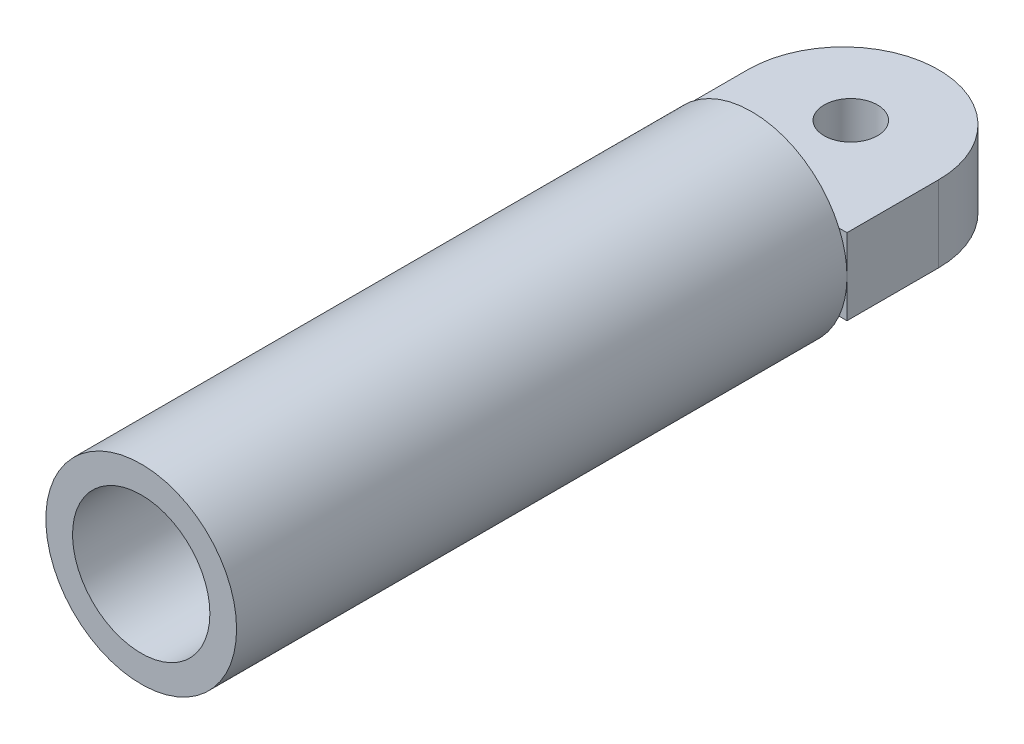
ISO-10303-21;
HEADER;
FILE_DESCRIPTION(('STEP AP214'),'2;1');
FILE_NAME('part.step','',(''),(''),'','','');
FILE_SCHEMA(('AUTOMOTIVE_DESIGN { 1 0 10303 214 1 1 1 1 }'));
ENDSEC;
DATA;
#1=APPLICATION_CONTEXT('core data for automotive mechanical design processes');
#2=APPLICATION_PROTOCOL_DEFINITION('international standard','automotive_design',2000,#1);
#3=PRODUCT_CONTEXT('',#1,'mechanical');
#4=PRODUCT('Part','Part','',(#3));
#5=PRODUCT_RELATED_PRODUCT_CATEGORY('part','',(#4));
#6=PRODUCT_DEFINITION_FORMATION('','',#4);
#7=PRODUCT_DEFINITION_CONTEXT('part definition',#1,'design');
#8=PRODUCT_DEFINITION('design','',#6,#7);
#9=PRODUCT_DEFINITION_SHAPE('','',#8);
#10=(LENGTH_UNIT() NAMED_UNIT(*) SI_UNIT(.MILLI.,.METRE.));
#11=(NAMED_UNIT(*) PLANE_ANGLE_UNIT() SI_UNIT($,.RADIAN.));
#12=(NAMED_UNIT(*) SI_UNIT($,.STERADIAN.) SOLID_ANGLE_UNIT());
#13=UNCERTAINTY_MEASURE_WITH_UNIT(LENGTH_MEASURE(1.E-05),#10,'distance_accuracy_value','');
#14=(GEOMETRIC_REPRESENTATION_CONTEXT(3) GLOBAL_UNCERTAINTY_ASSIGNED_CONTEXT((#13)) GLOBAL_UNIT_ASSIGNED_CONTEXT((#10,
#11,#12)) REPRESENTATION_CONTEXT('',''));
#15=CARTESIAN_POINT('',(0.,0.,0.));
#16=DIRECTION('',(0.,0.,1.));
#17=DIRECTION('',(1.,0.,0.));
#18=AXIS2_PLACEMENT_3D('',#15,#16,#17);
#19=CARTESIAN_POINT('',(0.,0.,0.));
#20=DIRECTION('',(0.,0.,1.));
#21=DIRECTION('',(1.,0.,0.));
#22=AXIS2_PLACEMENT_3D('',#19,#20,#21);
#23=PLANE('',#22);
#24=DIRECTION('',(1.,0.,0.));
#25=VECTOR('',#24,1.);
#26=CARTESIAN_POINT('',(-12.5,5.,0.));
#27=LINE('',#26,#25);
#28=CARTESIAN_POINT('',(-11.4564392373896,5.,0.));
#29=VERTEX_POINT('',#28);
#30=CARTESIAN_POINT('',(-7.48331477354788,5.,0.));
#31=VERTEX_POINT('',#30);
#32=EDGE_CURVE('E153',#29,#31,#27,.T.);
#33=ORIENTED_EDGE('',*,*,#32,.F.);
#34=CARTESIAN_POINT('',(0.,0.,0.));
#35=DIRECTION('',(0.,0.,1.));
#36=DIRECTION('',(1.,0.,0.));
#37=AXIS2_PLACEMENT_3D('',#34,#35,#36);
#38=CIRCLE('',#37,12.5);
#39=CARTESIAN_POINT('',(11.4564392373896,5.,0.));
#40=VERTEX_POINT('',#39);
#41=EDGE_CURVE('E154',#40,#29,#38,.T.);
#42=ORIENTED_EDGE('',*,*,#41,.F.);
#43=CARTESIAN_POINT('',(7.48331477354788,5.,0.));
#44=VERTEX_POINT('',#43);
#45=EDGE_CURVE('E120',#44,#40,#27,.T.);
#46=ORIENTED_EDGE('',*,*,#45,.F.);
#47=CARTESIAN_POINT('',(0.,0.,0.));
#48=DIRECTION('',(0.,0.,1.));
#49=DIRECTION('',(1.,0.,0.));
#50=AXIS2_PLACEMENT_3D('',#47,#48,#49);
#51=CIRCLE('',#50,9.);
#52=EDGE_CURVE('E139',#44,#31,#51,.T.);
#53=ORIENTED_EDGE('',*,*,#52,.T.);
#54=EDGE_LOOP('',(#33,#42,#46,#53));
#55=FACE_BOUND('',#54,.T.);
#56=ADVANCED_FACE('F34',(#55),#23,.F.);
#57=CARTESIAN_POINT('',(0.,0.,80.));
#58=DIRECTION('',(0.,0.,1.));
#59=DIRECTION('',(1.,0.,0.));
#60=AXIS2_PLACEMENT_3D('',#57,#58,#59);
#61=PLANE('',#60);
#62=CARTESIAN_POINT('',(0.,0.,80.));
#63=DIRECTION('',(0.,0.,1.));
#64=DIRECTION('',(1.,0.,0.));
#65=AXIS2_PLACEMENT_3D('',#62,#63,#64);
#66=CIRCLE('',#65,12.5);
#67=CARTESIAN_POINT('',(12.5,0.,80.));
#68=VERTEX_POINT('',#67);
#69=EDGE_CURVE('E148',#68,#68,#66,.T.);
#70=ORIENTED_EDGE('',*,*,#69,.T.);
#71=EDGE_LOOP('',(#70));
#72=FACE_BOUND('',#71,.T.);
#73=CARTESIAN_POINT('',(0.,0.,80.));
#74=DIRECTION('',(0.,0.,1.));
#75=DIRECTION('',(1.,0.,0.));
#76=AXIS2_PLACEMENT_3D('',#73,#74,#75);
#77=CIRCLE('',#76,9.);
#78=CARTESIAN_POINT('',(9.,0.,80.));
#79=VERTEX_POINT('',#78);
#80=EDGE_CURVE('E144',#79,#79,#77,.T.);
#81=ORIENTED_EDGE('',*,*,#80,.F.);
#82=EDGE_LOOP('',(#81));
#83=FACE_BOUND('',#82,.T.);
#84=ADVANCED_FACE('F221',(#72,#83),#61,.T.);
#85=CARTESIAN_POINT('',(-11.4564392373896,-5.,0.));
#86=VERTEX_POINT('',#85);
#87=CARTESIAN_POINT('',(11.4564392373896,-5.,0.));
#88=VERTEX_POINT('',#87);
#89=EDGE_CURVE('E159',#86,#88,#38,.T.);
#90=ORIENTED_EDGE('',*,*,#89,.F.);
#91=DIRECTION('',(1.,0.,0.));
#92=VECTOR('',#91,1.);
#93=CARTESIAN_POINT('',(-12.5,-5.,0.));
#94=LINE('',#93,#92);
#95=CARTESIAN_POINT('',(-7.48331477354788,-5.,0.));
#96=VERTEX_POINT('',#95);
#97=EDGE_CURVE('E11',#86,#96,#94,.T.);
#98=ORIENTED_EDGE('',*,*,#97,.T.);
#99=CARTESIAN_POINT('',(7.48331477354788,-5.,0.));
#100=VERTEX_POINT('',#99);
#101=EDGE_CURVE('E137',#96,#100,#51,.T.);
#102=ORIENTED_EDGE('',*,*,#101,.T.);
#103=EDGE_CURVE('E43',#100,#88,#94,.T.);
#104=ORIENTED_EDGE('',*,*,#103,.T.);
#105=EDGE_LOOP('',(#90,#98,#102,#104));
#106=FACE_BOUND('',#105,.T.);
#107=ADVANCED_FACE('F223',(#106),#23,.F.);
#108=CARTESIAN_POINT('',(0.,0.,80.));
#109=DIRECTION('',(0.,0.,-1.));
#110=DIRECTION('',(-1.,0.,0.));
#111=AXIS2_PLACEMENT_3D('',#108,#109,#110);
#112=CYLINDRICAL_SURFACE('',#111,12.5);
#113=ORIENTED_EDGE('',*,*,#69,.F.);
#114=EDGE_LOOP('',(#113));
#115=FACE_BOUND('',#114,.T.);
#116=CARTESIAN_POINT('',(12.5,0.,0.));
#117=VERTEX_POINT('',#116);
#118=EDGE_CURVE('E38',#117,#40,#38,.T.);
#119=ORIENTED_EDGE('',*,*,#118,.T.);
#120=ORIENTED_EDGE('',*,*,#41,.T.);
#121=CARTESIAN_POINT('',(-12.5,0.,0.));
#122=VERTEX_POINT('',#121);
#123=EDGE_CURVE('E113',#29,#122,#38,.T.);
#124=ORIENTED_EDGE('',*,*,#123,.T.);
#125=EDGE_CURVE('E162',#122,#86,#38,.T.);
#126=ORIENTED_EDGE('',*,*,#125,.T.);
#127=ORIENTED_EDGE('',*,*,#89,.T.);
#128=EDGE_CURVE('E146',#88,#117,#38,.T.);
#129=ORIENTED_EDGE('',*,*,#128,.T.);
#130=EDGE_LOOP('',(#119,#120,#124,#126,#127,#129));
#131=FACE_BOUND('',#130,.T.);
#132=ADVANCED_FACE('F36',(#115,#131),#112,.T.);
#133=CARTESIAN_POINT('',(0.,0.,80.));
#134=DIRECTION('',(0.,0.,-1.));
#135=DIRECTION('',(-1.,0.,0.));
#136=AXIS2_PLACEMENT_3D('',#133,#134,#135);
#137=CYLINDRICAL_SURFACE('',#136,9.);
#138=ORIENTED_EDGE('',*,*,#80,.T.);
#139=EDGE_LOOP('',(#138));
#140=FACE_BOUND('',#139,.T.);
#141=ORIENTED_EDGE('',*,*,#52,.F.);
#142=EDGE_CURVE('E52',#100,#44,#51,.T.);
#143=ORIENTED_EDGE('',*,*,#142,.F.);
#144=ORIENTED_EDGE('',*,*,#101,.F.);
#145=EDGE_CURVE('E147',#31,#96,#51,.T.);
#146=ORIENTED_EDGE('',*,*,#145,.F.);
#147=EDGE_LOOP('',(#141,#143,#144,#146));
#148=FACE_BOUND('',#147,.T.);
#149=ADVANCED_FACE('F232',(#140,#148),#137,.F.);
#150=CARTESIAN_POINT('',(-12.5,5.,0.));
#151=DIRECTION('',(0.,0.,-1.));
#152=DIRECTION('',(-1.,0.,0.));
#153=AXIS2_PLACEMENT_3D('',#150,#151,#152);
#154=PLANE('',#153);
#155=ORIENTED_EDGE('',*,*,#123,.F.);
#156=CARTESIAN_POINT('',(-12.5,5.,0.));
#157=VERTEX_POINT('',#156);
#158=EDGE_CURVE('E108',#157,#29,#27,.T.);
#159=ORIENTED_EDGE('',*,*,#158,.F.);
#160=DIRECTION('',(0.,-1.,0.));
#161=VECTOR('',#160,1.);
#162=CARTESIAN_POINT('',(-12.5,5.,0.));
#163=LINE('',#162,#161);
#164=EDGE_CURVE('E112',#157,#122,#163,.T.);
#165=ORIENTED_EDGE('',*,*,#164,.T.);
#166=EDGE_LOOP('',(#155,#159,#165));
#167=FACE_BOUND('',#166,.T.);
#168=ADVANCED_FACE('F110',(#167),#154,.F.);
#169=ORIENTED_EDGE('',*,*,#118,.F.);
#170=DIRECTION('',(0.,-1.,0.));
#171=VECTOR('',#170,1.);
#172=CARTESIAN_POINT('',(12.5,5.,0.));
#173=LINE('',#172,#171);
#174=CARTESIAN_POINT('',(12.5,5.,0.));
#175=VERTEX_POINT('',#174);
#176=EDGE_CURVE('E140',#175,#117,#173,.T.);
#177=ORIENTED_EDGE('',*,*,#176,.F.);
#178=EDGE_CURVE('E119',#40,#175,#27,.T.);
#179=ORIENTED_EDGE('',*,*,#178,.F.);
#180=EDGE_LOOP('',(#169,#177,#179));
#181=FACE_BOUND('',#180,.T.);
#182=ADVANCED_FACE('F189',(#181),#154,.F.);
#183=EDGE_CURVE('E117',#31,#44,#27,.T.);
#184=ORIENTED_EDGE('',*,*,#183,.F.);
#185=ORIENTED_EDGE('',*,*,#145,.T.);
#186=EDGE_CURVE('E45',#96,#100,#94,.T.);
#187=ORIENTED_EDGE('',*,*,#186,.T.);
#188=ORIENTED_EDGE('',*,*,#142,.T.);
#189=EDGE_LOOP('',(#184,#185,#187,#188));
#190=FACE_BOUND('',#189,.T.);
#191=ADVANCED_FACE('F256',(#190),#154,.F.);
#192=ORIENTED_EDGE('',*,*,#125,.F.);
#193=CARTESIAN_POINT('',(-12.5,-5.,0.));
#194=VERTEX_POINT('',#193);
#195=EDGE_CURVE('E135',#122,#194,#163,.T.);
#196=ORIENTED_EDGE('',*,*,#195,.T.);
#197=EDGE_CURVE('E169',#194,#86,#94,.T.);
#198=ORIENTED_EDGE('',*,*,#197,.T.);
#199=EDGE_LOOP('',(#192,#196,#198));
#200=FACE_BOUND('',#199,.T.);
#201=ADVANCED_FACE('F167',(#200),#154,.F.);
#202=CARTESIAN_POINT('',(0.,5.,-12.));
#203=DIRECTION('',(0.,-1.,0.));
#204=DIRECTION('',(0.,0.,-1.));
#205=AXIS2_PLACEMENT_3D('',#202,#203,#204);
#206=PLANE('',#205);
#207=DIRECTION('',(0.,0.,1.));
#208=VECTOR('',#207,1.);
#209=CARTESIAN_POINT('',(-12.5,5.,0.));
#210=LINE('',#209,#208);
#211=CARTESIAN_POINT('',(-12.5,5.,-12.));
#212=VERTEX_POINT('',#211);
#213=EDGE_CURVE('E122',#212,#157,#210,.T.);
#214=ORIENTED_EDGE('',*,*,#213,.T.);
#215=ORIENTED_EDGE('',*,*,#158,.T.);
#216=ORIENTED_EDGE('',*,*,#32,.T.);
#217=ORIENTED_EDGE('',*,*,#183,.T.);
#218=ORIENTED_EDGE('',*,*,#45,.T.);
#219=ORIENTED_EDGE('',*,*,#178,.T.);
#220=DIRECTION('',(0.,0.,-1.));
#221=VECTOR('',#220,1.);
#222=CARTESIAN_POINT('',(12.5,5.,0.));
#223=LINE('',#222,#221);
#224=CARTESIAN_POINT('',(12.5,5.,-12.));
#225=VERTEX_POINT('',#224);
#226=EDGE_CURVE('E116',#175,#225,#223,.T.);
#227=ORIENTED_EDGE('',*,*,#226,.T.);
#228=CARTESIAN_POINT('',(0.,5.,-12.));
#229=DIRECTION('',(0.,1.,0.));
#230=DIRECTION('',(0.,0.,-1.));
#231=AXIS2_PLACEMENT_3D('',#228,#229,#230);
#232=CIRCLE('',#231,12.5);
#233=EDGE_CURVE('E126',#225,#212,#232,.T.);
#234=ORIENTED_EDGE('',*,*,#233,.T.);
#235=EDGE_LOOP('',(#214,#215,#216,#217,#218,#219,#227,#234));
#236=FACE_BOUND('',#235,.T.);
#237=CARTESIAN_POINT('',(0.,5.,-13.));
#238=DIRECTION('',(0.,1.,0.));
#239=DIRECTION('',(0.,0.,1.));
#240=AXIS2_PLACEMENT_3D('',#237,#238,#239);
#241=CIRCLE('',#240,3.5);
#242=CARTESIAN_POINT('',(0.,5.,-9.5));
#243=VERTEX_POINT('',#242);
#244=EDGE_CURVE('E198',#243,#243,#241,.T.);
#245=ORIENTED_EDGE('',*,*,#244,.F.);
#246=EDGE_LOOP('',(#245));
#247=FACE_BOUND('',#246,.T.);
#248=ADVANCED_FACE('F123',(#236,#247),#206,.F.);
#249=CARTESIAN_POINT('',(0.,-5.,-12.));
#250=DIRECTION('',(0.,-1.,0.));
#251=DIRECTION('',(0.,0.,-1.));
#252=AXIS2_PLACEMENT_3D('',#249,#250,#251);
#253=PLANE('',#252);
#254=DIRECTION('',(0.,0.,1.));
#255=VECTOR('',#254,1.);
#256=CARTESIAN_POINT('',(-12.5,-5.,0.));
#257=LINE('',#256,#255);
#258=CARTESIAN_POINT('',(-12.5,-5.,-12.));
#259=VERTEX_POINT('',#258);
#260=EDGE_CURVE('E178',#259,#194,#257,.T.);
#261=ORIENTED_EDGE('',*,*,#260,.F.);
#262=CARTESIAN_POINT('',(0.,-5.,-12.));
#263=DIRECTION('',(0.,1.,0.));
#264=DIRECTION('',(0.,0.,-1.));
#265=AXIS2_PLACEMENT_3D('',#262,#263,#264);
#266=CIRCLE('',#265,12.5);
#267=CARTESIAN_POINT('',(12.5,-5.,-12.));
#268=VERTEX_POINT('',#267);
#269=EDGE_CURVE('E130',#268,#259,#266,.T.);
#270=ORIENTED_EDGE('',*,*,#269,.F.);
#271=DIRECTION('',(0.,0.,-1.));
#272=VECTOR('',#271,1.);
#273=CARTESIAN_POINT('',(12.5,-5.,0.));
#274=LINE('',#273,#272);
#275=CARTESIAN_POINT('',(12.5,-5.,0.));
#276=VERTEX_POINT('',#275);
#277=EDGE_CURVE('E172',#276,#268,#274,.T.);
#278=ORIENTED_EDGE('',*,*,#277,.F.);
#279=EDGE_CURVE('E173',#88,#276,#94,.T.);
#280=ORIENTED_EDGE('',*,*,#279,.F.);
#281=ORIENTED_EDGE('',*,*,#103,.F.);
#282=ORIENTED_EDGE('',*,*,#186,.F.);
#283=ORIENTED_EDGE('',*,*,#97,.F.);
#284=ORIENTED_EDGE('',*,*,#197,.F.);
#285=EDGE_LOOP('',(#261,#270,#278,#280,#281,#282,#283,#284));
#286=FACE_BOUND('',#285,.T.);
#287=CARTESIAN_POINT('',(0.,-5.,-13.));
#288=DIRECTION('',(0.,1.,0.));
#289=DIRECTION('',(0.,0.,1.));
#290=AXIS2_PLACEMENT_3D('',#287,#288,#289);
#291=CIRCLE('',#290,3.5);
#292=CARTESIAN_POINT('',(0.,-5.,-9.5));
#293=VERTEX_POINT('',#292);
#294=EDGE_CURVE('E200',#293,#293,#291,.T.);
#295=ORIENTED_EDGE('',*,*,#294,.T.);
#296=EDGE_LOOP('',(#295));
#297=FACE_BOUND('',#296,.T.);
#298=ADVANCED_FACE('F208',(#286,#297),#253,.T.);
#299=CARTESIAN_POINT('',(-12.5,5.,0.));
#300=DIRECTION('',(1.,0.,0.));
#301=DIRECTION('',(0.,0.,-1.));
#302=AXIS2_PLACEMENT_3D('',#299,#300,#301);
#303=PLANE('',#302);
#304=ORIENTED_EDGE('',*,*,#260,.T.);
#305=ORIENTED_EDGE('',*,*,#195,.F.);
#306=ORIENTED_EDGE('',*,*,#164,.F.);
#307=ORIENTED_EDGE('',*,*,#213,.F.);
#308=DIRECTION('',(0.,-1.,0.));
#309=VECTOR('',#308,1.);
#310=CARTESIAN_POINT('',(-12.5,5.,-12.));
#311=LINE('',#310,#309);
#312=EDGE_CURVE('E196',#212,#259,#311,.T.);
#313=ORIENTED_EDGE('',*,*,#312,.T.);
#314=EDGE_LOOP('',(#304,#305,#306,#307,#313));
#315=FACE_BOUND('',#314,.T.);
#316=ADVANCED_FACE('F134',(#315),#303,.F.);
#317=ORIENTED_EDGE('',*,*,#128,.F.);
#318=ORIENTED_EDGE('',*,*,#279,.T.);
#319=EDGE_CURVE('E192',#117,#276,#173,.T.);
#320=ORIENTED_EDGE('',*,*,#319,.F.);
#321=EDGE_LOOP('',(#317,#318,#320));
#322=FACE_BOUND('',#321,.T.);
#323=ADVANCED_FACE('F243',(#322),#154,.F.);
#324=CARTESIAN_POINT('',(12.5,5.,0.));
#325=DIRECTION('',(-1.,0.,0.));
#326=DIRECTION('',(0.,0.,1.));
#327=AXIS2_PLACEMENT_3D('',#324,#325,#326);
#328=PLANE('',#327);
#329=ORIENTED_EDGE('',*,*,#277,.T.);
#330=DIRECTION('',(0.,-1.,0.));
#331=VECTOR('',#330,1.);
#332=CARTESIAN_POINT('',(12.5,5.,-12.));
#333=LINE('',#332,#331);
#334=EDGE_CURVE('E195',#225,#268,#333,.T.);
#335=ORIENTED_EDGE('',*,*,#334,.F.);
#336=ORIENTED_EDGE('',*,*,#226,.F.);
#337=ORIENTED_EDGE('',*,*,#176,.T.);
#338=ORIENTED_EDGE('',*,*,#319,.T.);
#339=EDGE_LOOP('',(#329,#335,#336,#337,#338));
#340=FACE_BOUND('',#339,.T.);
#341=ADVANCED_FACE('F193',(#340),#328,.F.);
#342=CARTESIAN_POINT('',(0.,5.,-12.));
#343=DIRECTION('',(0.,-1.,0.));
#344=DIRECTION('',(0.,0.,-1.));
#345=AXIS2_PLACEMENT_3D('',#342,#343,#344);
#346=CYLINDRICAL_SURFACE('',#345,12.5);
#347=ORIENTED_EDGE('',*,*,#269,.T.);
#348=ORIENTED_EDGE('',*,*,#312,.F.);
#349=ORIENTED_EDGE('',*,*,#233,.F.);
#350=ORIENTED_EDGE('',*,*,#334,.T.);
#351=EDGE_LOOP('',(#347,#348,#349,#350));
#352=FACE_BOUND('',#351,.T.);
#353=ADVANCED_FACE('F212',(#352),#346,.T.);
#354=CARTESIAN_POINT('',(0.,5.,-13.));
#355=DIRECTION('',(0.,-1.,0.));
#356=DIRECTION('',(0.,0.,-1.));
#357=AXIS2_PLACEMENT_3D('',#354,#355,#356);
#358=CYLINDRICAL_SURFACE('',#357,3.5);
#359=ORIENTED_EDGE('',*,*,#244,.T.);
#360=EDGE_LOOP('',(#359));
#361=FACE_BOUND('',#360,.T.);
#362=ORIENTED_EDGE('',*,*,#294,.F.);
#363=EDGE_LOOP('',(#362));
#364=FACE_BOUND('',#363,.T.);
#365=ADVANCED_FACE('F210',(#361,#364),#358,.F.);
#366=CLOSED_SHELL('',(#56,#84,#107,#132,#149,#168,#182,#191,#201,#248,#298,#316,#323,#341,#353,#365));
#367=MANIFOLD_SOLID_BREP('B2',#366);
#368=ADVANCED_BREP_SHAPE_REPRESENTATION('',(#18,#367),#14);
#369=SHAPE_DEFINITION_REPRESENTATION(#9,#368);
ENDSEC;
END-ISO-10303-21;
